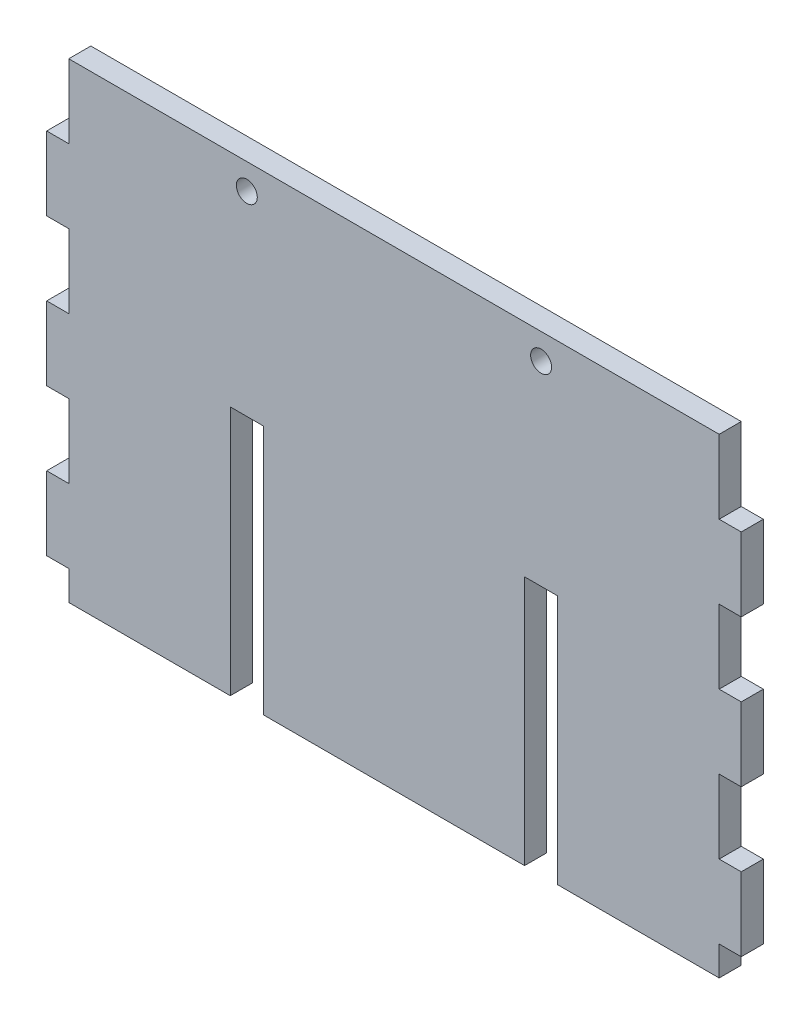
ISO-10303-21;
HEADER;
FILE_DESCRIPTION(('STEP AP214'),'2;1');
FILE_NAME('part.step','',(''),(''),'','','');
FILE_SCHEMA(('AUTOMOTIVE_DESIGN { 1 0 10303 214 1 1 1 1 }'));
ENDSEC;
DATA;
#1=APPLICATION_CONTEXT('core data for automotive mechanical design processes');
#2=APPLICATION_PROTOCOL_DEFINITION('international standard','automotive_design',2000,#1);
#3=PRODUCT_CONTEXT('',#1,'mechanical');
#4=PRODUCT('Part','Part','',(#3));
#5=PRODUCT_RELATED_PRODUCT_CATEGORY('part','',(#4));
#6=PRODUCT_DEFINITION_FORMATION('','',#4);
#7=PRODUCT_DEFINITION_CONTEXT('part definition',#1,'design');
#8=PRODUCT_DEFINITION('design','',#6,#7);
#9=PRODUCT_DEFINITION_SHAPE('','',#8);
#10=(LENGTH_UNIT() NAMED_UNIT(*) SI_UNIT(.MILLI.,.METRE.));
#11=(NAMED_UNIT(*) PLANE_ANGLE_UNIT() SI_UNIT($,.RADIAN.));
#12=(NAMED_UNIT(*) SI_UNIT($,.STERADIAN.) SOLID_ANGLE_UNIT());
#13=UNCERTAINTY_MEASURE_WITH_UNIT(LENGTH_MEASURE(1.E-05),#10,'distance_accuracy_value','');
#14=(GEOMETRIC_REPRESENTATION_CONTEXT(3) GLOBAL_UNCERTAINTY_ASSIGNED_CONTEXT((#13)) GLOBAL_UNIT_ASSIGNED_CONTEXT((#10,
#11,#12)) REPRESENTATION_CONTEXT('',''));
#15=CARTESIAN_POINT('',(0.,0.,0.));
#16=DIRECTION('',(0.,0.,1.));
#17=DIRECTION('',(1.,0.,0.));
#18=AXIS2_PLACEMENT_3D('',#15,#16,#17);
#19=CARTESIAN_POINT('',(-47.2,-32.,3.));
#20=DIRECTION('',(0.,1.,0.));
#21=DIRECTION('',(0.,0.,1.));
#22=AXIS2_PLACEMENT_3D('',#19,#20,#21);
#23=PLANE('',#22);
#24=DIRECTION('',(1.,0.,0.));
#25=VECTOR('',#24,1.);
#26=CARTESIAN_POINT('',(-47.2,-32.,0.));
#27=LINE('',#26,#25);
#28=CARTESIAN_POINT('',(-17.75,-32.,0.));
#29=VERTEX_POINT('',#28);
#30=CARTESIAN_POINT('',(17.75,-32.,0.));
#31=VERTEX_POINT('',#30);
#32=EDGE_CURVE('E534',#29,#31,#27,.T.);
#33=ORIENTED_EDGE('',*,*,#32,.T.);
#34=DIRECTION('',(0.,0.,-1.));
#35=VECTOR('',#34,1.);
#36=CARTESIAN_POINT('',(17.75,-32.,10.));
#37=LINE('',#36,#35);
#38=CARTESIAN_POINT('',(17.75,-32.,3.));
#39=VERTEX_POINT('',#38);
#40=EDGE_CURVE('E295',#39,#31,#37,.T.);
#41=ORIENTED_EDGE('',*,*,#40,.F.);
#42=DIRECTION('',(1.,0.,0.));
#43=VECTOR('',#42,1.);
#44=CARTESIAN_POINT('',(-47.2,-32.,3.));
#45=LINE('',#44,#43);
#46=CARTESIAN_POINT('',(-17.75,-32.,3.));
#47=VERTEX_POINT('',#46);
#48=EDGE_CURVE('E520',#47,#39,#45,.T.);
#49=ORIENTED_EDGE('',*,*,#48,.F.);
#50=DIRECTION('',(0.,0.,-1.));
#51=VECTOR('',#50,1.);
#52=CARTESIAN_POINT('',(-17.75,-32.,10.));
#53=LINE('',#52,#51);
#54=EDGE_CURVE('E309',#47,#29,#53,.T.);
#55=ORIENTED_EDGE('',*,*,#54,.T.);
#56=EDGE_LOOP('',(#33,#41,#49,#55));
#57=FACE_BOUND('',#56,.T.);
#58=ADVANCED_FACE('F35',(#57),#23,.F.);
#59=CARTESIAN_POINT('',(-44.1999999999996,-32.,0.));
#60=VERTEX_POINT('',#59);
#61=CARTESIAN_POINT('',(-22.25,-32.,0.));
#62=VERTEX_POINT('',#61);
#63=EDGE_CURVE('E508',#60,#62,#27,.T.);
#64=ORIENTED_EDGE('',*,*,#63,.T.);
#65=DIRECTION('',(0.,0.,-1.));
#66=VECTOR('',#65,1.);
#67=CARTESIAN_POINT('',(-22.25,-32.,10.));
#68=LINE('',#67,#66);
#69=CARTESIAN_POINT('',(-22.25,-32.,3.));
#70=VERTEX_POINT('',#69);
#71=EDGE_CURVE('E307',#70,#62,#68,.T.);
#72=ORIENTED_EDGE('',*,*,#71,.F.);
#73=CARTESIAN_POINT('',(-44.1999999999996,-32.,3.));
#74=VERTEX_POINT('',#73);
#75=EDGE_CURVE('E43',#74,#70,#45,.T.);
#76=ORIENTED_EDGE('',*,*,#75,.F.);
#77=DIRECTION('',(0.,0.,-1.));
#78=VECTOR('',#77,1.);
#79=CARTESIAN_POINT('',(-44.1999999999996,-32.,3.));
#80=LINE('',#79,#78);
#81=EDGE_CURVE('E493',#74,#60,#80,.T.);
#82=ORIENTED_EDGE('',*,*,#81,.T.);
#83=EDGE_LOOP('',(#64,#72,#76,#82));
#84=FACE_BOUND('',#83,.T.);
#85=ADVANCED_FACE('F613',(#84),#23,.F.);
#86=CARTESIAN_POINT('',(-47.2,-32.,3.));
#87=DIRECTION('',(-1.,0.,0.));
#88=DIRECTION('',(0.,0.,1.));
#89=AXIS2_PLACEMENT_3D('',#86,#87,#88);
#90=PLANE('',#89);
#91=DIRECTION('',(0.,0.,-1.));
#92=VECTOR('',#91,1.);
#93=CARTESIAN_POINT('',(-47.1999999999994,-28.,3.));
#94=LINE('',#93,#92);
#95=CARTESIAN_POINT('',(-47.1999999999994,-28.,3.));
#96=VERTEX_POINT('',#95);
#97=CARTESIAN_POINT('',(-47.2,-28.,0.));
#98=VERTEX_POINT('',#97);
#99=EDGE_CURVE('E474',#96,#98,#94,.T.);
#100=ORIENTED_EDGE('',*,*,#99,.F.);
#101=DIRECTION('',(0.,1.,0.));
#102=VECTOR('',#101,1.);
#103=CARTESIAN_POINT('',(-47.2,-32.,3.));
#104=LINE('',#103,#102);
#105=CARTESIAN_POINT('',(-47.1999999999996,-18.,3.));
#106=VERTEX_POINT('',#105);
#107=EDGE_CURVE('E509',#96,#106,#104,.T.);
#108=ORIENTED_EDGE('',*,*,#107,.T.);
#109=DIRECTION('',(0.,0.,-1.));
#110=VECTOR('',#109,1.);
#111=CARTESIAN_POINT('',(-47.1999999999996,-18.,3.));
#112=LINE('',#111,#110);
#113=CARTESIAN_POINT('',(-47.1999999999996,-18.,0.));
#114=VERTEX_POINT('',#113);
#115=EDGE_CURVE('E349',#106,#114,#112,.T.);
#116=ORIENTED_EDGE('',*,*,#115,.T.);
#117=DIRECTION('',(0.,1.,0.));
#118=VECTOR('',#117,1.);
#119=CARTESIAN_POINT('',(-47.2,-32.,0.));
#120=LINE('',#119,#118);
#121=EDGE_CURVE('E525',#98,#114,#120,.T.);
#122=ORIENTED_EDGE('',*,*,#121,.F.);
#123=EDGE_LOOP('',(#100,#108,#116,#122));
#124=FACE_BOUND('',#123,.T.);
#125=ADVANCED_FACE('F619',(#124),#90,.T.);
#126=DIRECTION('',(0.,0.,-1.));
#127=VECTOR('',#126,1.);
#128=CARTESIAN_POINT('',(-47.1999999999996,-7.99999999999999,3.));
#129=LINE('',#128,#127);
#130=CARTESIAN_POINT('',(-47.1999999999996,-7.99999999999999,3.));
#131=VERTEX_POINT('',#130);
#132=CARTESIAN_POINT('',(-47.2,-7.99999999999999,0.));
#133=VERTEX_POINT('',#132);
#134=EDGE_CURVE('E340',#131,#133,#129,.T.);
#135=ORIENTED_EDGE('',*,*,#134,.F.);
#136=CARTESIAN_POINT('',(-47.1999999999998,2.00000000000001,3.));
#137=VERTEX_POINT('',#136);
#138=EDGE_CURVE('E507',#131,#137,#104,.T.);
#139=ORIENTED_EDGE('',*,*,#138,.T.);
#140=DIRECTION('',(0.,0.,-1.));
#141=VECTOR('',#140,1.);
#142=CARTESIAN_POINT('',(-47.1999999999998,2.00000000000001,3.));
#143=LINE('',#142,#141);
#144=CARTESIAN_POINT('',(-47.1999999999998,2.00000000000001,0.));
#145=VERTEX_POINT('',#144);
#146=EDGE_CURVE('E345',#137,#145,#143,.T.);
#147=ORIENTED_EDGE('',*,*,#146,.T.);
#148=EDGE_CURVE('E524',#133,#145,#120,.T.);
#149=ORIENTED_EDGE('',*,*,#148,.F.);
#150=EDGE_LOOP('',(#135,#139,#147,#149));
#151=FACE_BOUND('',#150,.T.);
#152=ADVANCED_FACE('F629',(#151),#90,.T.);
#153=CARTESIAN_POINT('',(47.2,-32.,3.));
#154=DIRECTION('',(-1.,0.,0.));
#155=DIRECTION('',(0.,0.,1.));
#156=AXIS2_PLACEMENT_3D('',#153,#154,#155);
#157=PLANE('',#156);
#158=DIRECTION('',(0.,1.,0.));
#159=VECTOR('',#158,1.);
#160=CARTESIAN_POINT('',(47.2,-32.,0.));
#161=LINE('',#160,#159);
#162=CARTESIAN_POINT('',(47.1999999999996,-7.99999999999999,0.));
#163=VERTEX_POINT('',#162);
#164=CARTESIAN_POINT('',(47.1999999999998,2.00000000000001,0.));
#165=VERTEX_POINT('',#164);
#166=EDGE_CURVE('E531',#163,#165,#161,.T.);
#167=ORIENTED_EDGE('',*,*,#166,.T.);
#168=DIRECTION('',(0.,0.,-1.));
#169=VECTOR('',#168,1.);
#170=CARTESIAN_POINT('',(47.1999999999998,2.00000000000001,3.));
#171=LINE('',#170,#169);
#172=CARTESIAN_POINT('',(47.1999999999998,2.00000000000001,3.));
#173=VERTEX_POINT('',#172);
#174=EDGE_CURVE('E421',#173,#165,#171,.T.);
#175=ORIENTED_EDGE('',*,*,#174,.F.);
#176=DIRECTION('',(0.,1.,0.));
#177=VECTOR('',#176,1.);
#178=CARTESIAN_POINT('',(47.2,-32.,3.));
#179=LINE('',#178,#177);
#180=CARTESIAN_POINT('',(47.1999999999996,-7.99999999999999,3.));
#181=VERTEX_POINT('',#180);
#182=EDGE_CURVE('E516',#181,#173,#179,.T.);
#183=ORIENTED_EDGE('',*,*,#182,.F.);
#184=DIRECTION('',(0.,0.,-1.));
#185=VECTOR('',#184,1.);
#186=CARTESIAN_POINT('',(47.1999999999996,-7.99999999999999,3.));
#187=LINE('',#186,#185);
#188=EDGE_CURVE('E449',#181,#163,#187,.T.);
#189=ORIENTED_EDGE('',*,*,#188,.T.);
#190=EDGE_LOOP('',(#167,#175,#183,#189));
#191=FACE_BOUND('',#190,.T.);
#192=ADVANCED_FACE('F549',(#191),#157,.F.);
#193=CARTESIAN_POINT('',(47.1999999999994,-28.,0.));
#194=VERTEX_POINT('',#193);
#195=CARTESIAN_POINT('',(47.1999999999996,-18.,0.));
#196=VERTEX_POINT('',#195);
#197=EDGE_CURVE('E532',#194,#196,#161,.T.);
#198=ORIENTED_EDGE('',*,*,#197,.T.);
#199=DIRECTION('',(0.,0.,-1.));
#200=VECTOR('',#199,1.);
#201=CARTESIAN_POINT('',(47.1999999999996,-18.,3.));
#202=LINE('',#201,#200);
#203=CARTESIAN_POINT('',(47.1999999999996,-18.,3.));
#204=VERTEX_POINT('',#203);
#205=EDGE_CURVE('E447',#204,#196,#202,.T.);
#206=ORIENTED_EDGE('',*,*,#205,.F.);
#207=CARTESIAN_POINT('',(47.1999999999994,-28.,3.));
#208=VERTEX_POINT('',#207);
#209=EDGE_CURVE('E517',#208,#204,#179,.T.);
#210=ORIENTED_EDGE('',*,*,#209,.F.);
#211=DIRECTION('',(0.,0.,-1.));
#212=VECTOR('',#211,1.);
#213=CARTESIAN_POINT('',(47.1999999999994,-28.,3.));
#214=LINE('',#213,#212);
#215=EDGE_CURVE('E442',#208,#194,#214,.T.);
#216=ORIENTED_EDGE('',*,*,#215,.T.);
#217=EDGE_LOOP('',(#198,#206,#210,#216));
#218=FACE_BOUND('',#217,.T.);
#219=ADVANCED_FACE('F627',(#218),#157,.F.);
#220=DIRECTION('',(0.,0.,-1.));
#221=VECTOR('',#220,1.);
#222=CARTESIAN_POINT('',(-47.1999999999998,12.,3.));
#223=LINE('',#222,#221);
#224=CARTESIAN_POINT('',(-47.1999999999998,12.,3.));
#225=VERTEX_POINT('',#224);
#226=CARTESIAN_POINT('',(-47.2,12.,0.));
#227=VERTEX_POINT('',#226);
#228=EDGE_CURVE('E368',#225,#227,#223,.T.);
#229=ORIENTED_EDGE('',*,*,#228,.F.);
#230=CARTESIAN_POINT('',(-47.2,22.,3.));
#231=VERTEX_POINT('',#230);
#232=EDGE_CURVE('E504',#225,#231,#104,.T.);
#233=ORIENTED_EDGE('',*,*,#232,.T.);
#234=DIRECTION('',(0.,0.,-1.));
#235=VECTOR('',#234,1.);
#236=CARTESIAN_POINT('',(-47.2,22.,3.));
#237=LINE('',#236,#235);
#238=CARTESIAN_POINT('',(-47.2,22.,0.));
#239=VERTEX_POINT('',#238);
#240=EDGE_CURVE('E373',#231,#239,#237,.T.);
#241=ORIENTED_EDGE('',*,*,#240,.T.);
#242=EDGE_CURVE('E503',#227,#239,#120,.T.);
#243=ORIENTED_EDGE('',*,*,#242,.F.);
#244=EDGE_LOOP('',(#229,#233,#241,#243));
#245=FACE_BOUND('',#244,.T.);
#246=ADVANCED_FACE('F37',(#245),#90,.T.);
#247=CARTESIAN_POINT('',(22.25,-32.,3.));
#248=VERTEX_POINT('',#247);
#249=CARTESIAN_POINT('',(44.1999999999996,-32.,3.));
#250=VERTEX_POINT('',#249);
#251=EDGE_CURVE('E521',#248,#250,#45,.T.);
#252=ORIENTED_EDGE('',*,*,#251,.F.);
#253=DIRECTION('',(0.,0.,-1.));
#254=VECTOR('',#253,1.);
#255=CARTESIAN_POINT('',(22.25,-32.,10.));
#256=LINE('',#255,#254);
#257=CARTESIAN_POINT('',(22.25,-32.,0.));
#258=VERTEX_POINT('',#257);
#259=EDGE_CURVE('E279',#248,#258,#256,.T.);
#260=ORIENTED_EDGE('',*,*,#259,.T.);
#261=CARTESIAN_POINT('',(44.1999999999996,-32.,0.));
#262=VERTEX_POINT('',#261);
#263=EDGE_CURVE('E290',#258,#262,#27,.T.);
#264=ORIENTED_EDGE('',*,*,#263,.T.);
#265=DIRECTION('',(0.,0.,1.));
#266=VECTOR('',#265,1.);
#267=CARTESIAN_POINT('',(44.1999999999996,-32.,3.));
#268=LINE('',#267,#266);
#269=EDGE_CURVE('E500',#262,#250,#268,.T.);
#270=ORIENTED_EDGE('',*,*,#269,.T.);
#271=EDGE_LOOP('',(#252,#260,#264,#270));
#272=FACE_BOUND('',#271,.T.);
#273=ADVANCED_FACE('F615',(#272),#23,.F.);
#274=CARTESIAN_POINT('',(47.1999999999998,12.,3.));
#275=VERTEX_POINT('',#274);
#276=CARTESIAN_POINT('',(47.2,22.,3.));
#277=VERTEX_POINT('',#276);
#278=EDGE_CURVE('E513',#275,#277,#179,.T.);
#279=ORIENTED_EDGE('',*,*,#278,.F.);
#280=DIRECTION('',(0.,0.,-1.));
#281=VECTOR('',#280,1.);
#282=CARTESIAN_POINT('',(47.1999999999998,12.,3.));
#283=LINE('',#282,#281);
#284=CARTESIAN_POINT('',(47.1999999999998,12.,0.));
#285=VERTEX_POINT('',#284);
#286=EDGE_CURVE('E423',#275,#285,#283,.T.);
#287=ORIENTED_EDGE('',*,*,#286,.T.);
#288=CARTESIAN_POINT('',(47.2,22.,0.));
#289=VERTEX_POINT('',#288);
#290=EDGE_CURVE('E529',#285,#289,#161,.T.);
#291=ORIENTED_EDGE('',*,*,#290,.T.);
#292=DIRECTION('',(0.,0.,-1.));
#293=VECTOR('',#292,1.);
#294=CARTESIAN_POINT('',(47.2,22.,3.));
#295=LINE('',#294,#293);
#296=EDGE_CURVE('E494',#277,#289,#295,.T.);
#297=ORIENTED_EDGE('',*,*,#296,.F.);
#298=EDGE_LOOP('',(#279,#287,#291,#297));
#299=FACE_BOUND('',#298,.T.);
#300=ADVANCED_FACE('F609',(#299),#157,.F.);
#301=CARTESIAN_POINT('',(-47.2,32.,3.));
#302=DIRECTION('',(0.,1.,0.));
#303=DIRECTION('',(0.,0.,1.));
#304=AXIS2_PLACEMENT_3D('',#301,#302,#303);
#305=PLANE('',#304);
#306=DIRECTION('',(0.,0.,-1.));
#307=VECTOR('',#306,1.);
#308=CARTESIAN_POINT('',(-44.2000000000002,32.,3.));
#309=LINE('',#308,#307);
#310=CARTESIAN_POINT('',(-44.2000000000002,32.,3.));
#311=VERTEX_POINT('',#310);
#312=CARTESIAN_POINT('',(-44.2000000000002,32.,0.));
#313=VERTEX_POINT('',#312);
#314=EDGE_CURVE('E391',#311,#313,#309,.T.);
#315=ORIENTED_EDGE('',*,*,#314,.F.);
#316=DIRECTION('',(1.,0.,0.));
#317=VECTOR('',#316,1.);
#318=CARTESIAN_POINT('',(-47.2,32.,3.));
#319=LINE('',#318,#317);
#320=CARTESIAN_POINT('',(44.2000000000002,32.,3.));
#321=VERTEX_POINT('',#320);
#322=EDGE_CURVE('E510',#311,#321,#319,.T.);
#323=ORIENTED_EDGE('',*,*,#322,.T.);
#324=DIRECTION('',(0.,0.,-1.));
#325=VECTOR('',#324,1.);
#326=CARTESIAN_POINT('',(44.2000000000002,32.,3.));
#327=LINE('',#326,#325);
#328=CARTESIAN_POINT('',(44.2000000000002,32.,0.));
#329=VERTEX_POINT('',#328);
#330=EDGE_CURVE('E487',#321,#329,#327,.T.);
#331=ORIENTED_EDGE('',*,*,#330,.T.);
#332=DIRECTION('',(1.,0.,0.));
#333=VECTOR('',#332,1.);
#334=CARTESIAN_POINT('',(-47.2,32.,0.));
#335=LINE('',#334,#333);
#336=EDGE_CURVE('E526',#313,#329,#335,.T.);
#337=ORIENTED_EDGE('',*,*,#336,.F.);
#338=EDGE_LOOP('',(#315,#323,#331,#337));
#339=FACE_BOUND('',#338,.T.);
#340=ADVANCED_FACE('F603',(#339),#305,.T.);
#341=CARTESIAN_POINT('',(0.,0.,3.));
#342=DIRECTION('',(0.,0.,-1.));
#343=DIRECTION('',(-1.,0.,0.));
#344=AXIS2_PLACEMENT_3D('',#341,#342,#343);
#345=PLANE('',#344);
#346=CARTESIAN_POINT('',(20.,28.5,3.));
#347=DIRECTION('',(0.,0.,-1.));
#348=DIRECTION('',(-1.,0.,0.));
#349=AXIS2_PLACEMENT_3D('',#346,#347,#348);
#350=CIRCLE('',#349,1.4224);
#351=CARTESIAN_POINT('',(18.5776,28.5,3.));
#352=VERTEX_POINT('',#351);
#353=EDGE_CURVE('E301',#352,#352,#350,.T.);
#354=ORIENTED_EDGE('',*,*,#353,.T.);
#355=EDGE_LOOP('',(#354));
#356=FACE_BOUND('',#355,.T.);
#357=CARTESIAN_POINT('',(-20.,28.5,3.));
#358=DIRECTION('',(0.,0.,-1.));
#359=DIRECTION('',(-1.,0.,0.));
#360=AXIS2_PLACEMENT_3D('',#357,#358,#359);
#361=CIRCLE('',#360,1.4224);
#362=CARTESIAN_POINT('',(-21.4224,28.5,3.));
#363=VERTEX_POINT('',#362);
#364=EDGE_CURVE('E577',#363,#363,#361,.T.);
#365=ORIENTED_EDGE('',*,*,#364,.T.);
#366=EDGE_LOOP('',(#365));
#367=FACE_BOUND('',#366,.T.);
#368=ORIENTED_EDGE('',*,*,#48,.T.);
#369=DIRECTION('',(0.,1.,0.));
#370=VECTOR('',#369,1.);
#371=CARTESIAN_POINT('',(17.75,0.,3.));
#372=LINE('',#371,#370);
#373=CARTESIAN_POINT('',(17.75,2.,3.));
#374=VERTEX_POINT('',#373);
#375=EDGE_CURVE('E326',#39,#374,#372,.T.);
#376=ORIENTED_EDGE('',*,*,#375,.T.);
#377=DIRECTION('',(1.,0.,0.));
#378=VECTOR('',#377,1.);
#379=CARTESIAN_POINT('',(0.,2.,3.));
#380=LINE('',#379,#378);
#381=CARTESIAN_POINT('',(22.25,2.,3.));
#382=VERTEX_POINT('',#381);
#383=EDGE_CURVE('E323',#374,#382,#380,.T.);
#384=ORIENTED_EDGE('',*,*,#383,.T.);
#385=DIRECTION('',(0.,-1.,0.));
#386=VECTOR('',#385,1.);
#387=CARTESIAN_POINT('',(22.25,0.,3.));
#388=LINE('',#387,#386);
#389=EDGE_CURVE('E276',#382,#248,#388,.T.);
#390=ORIENTED_EDGE('',*,*,#389,.T.);
#391=ORIENTED_EDGE('',*,*,#251,.T.);
#392=DIRECTION('',(0.,1.,0.));
#393=VECTOR('',#392,1.);
#394=CARTESIAN_POINT('',(44.1999999999996,-28.,3.));
#395=LINE('',#394,#393);
#396=CARTESIAN_POINT('',(44.1999999999996,-28.,3.));
#397=VERTEX_POINT('',#396);
#398=EDGE_CURVE('E454',#250,#397,#395,.T.);
#399=ORIENTED_EDGE('',*,*,#398,.T.);
#400=DIRECTION('',(1.,0.,0.));
#401=VECTOR('',#400,1.);
#402=CARTESIAN_POINT('',(47.1999999999994,-28.,3.));
#403=LINE('',#402,#401);
#404=EDGE_CURVE('E457',#397,#208,#403,.T.);
#405=ORIENTED_EDGE('',*,*,#404,.T.);
#406=ORIENTED_EDGE('',*,*,#209,.T.);
#407=DIRECTION('',(-1.,0.,0.));
#408=VECTOR('',#407,1.);
#409=CARTESIAN_POINT('',(47.1999999999996,-18.,3.));
#410=LINE('',#409,#408);
#411=CARTESIAN_POINT('',(44.1999999999998,-18.,3.));
#412=VERTEX_POINT('',#411);
#413=EDGE_CURVE('E435',#204,#412,#410,.T.);
#414=ORIENTED_EDGE('',*,*,#413,.T.);
#415=DIRECTION('',(0.,1.,0.));
#416=VECTOR('',#415,1.);
#417=CARTESIAN_POINT('',(44.1999999999998,-7.99999999999999,3.));
#418=LINE('',#417,#416);
#419=CARTESIAN_POINT('',(44.1999999999998,-7.99999999999999,3.));
#420=VERTEX_POINT('',#419);
#421=EDGE_CURVE('E428',#412,#420,#418,.T.);
#422=ORIENTED_EDGE('',*,*,#421,.T.);
#423=DIRECTION('',(1.,0.,0.));
#424=VECTOR('',#423,1.);
#425=CARTESIAN_POINT('',(47.1999999999996,-7.99999999999999,3.));
#426=LINE('',#425,#424);
#427=EDGE_CURVE('E431',#420,#181,#426,.T.);
#428=ORIENTED_EDGE('',*,*,#427,.T.);
#429=ORIENTED_EDGE('',*,*,#182,.T.);
#430=DIRECTION('',(-1.,0.,0.));
#431=VECTOR('',#430,1.);
#432=CARTESIAN_POINT('',(47.1999999999998,2.00000000000001,3.));
#433=LINE('',#432,#431);
#434=CARTESIAN_POINT('',(44.2,2.00000000000001,3.));
#435=VERTEX_POINT('',#434);
#436=EDGE_CURVE('E407',#173,#435,#433,.T.);
#437=ORIENTED_EDGE('',*,*,#436,.T.);
#438=DIRECTION('',(0.,1.,0.));
#439=VECTOR('',#438,1.);
#440=CARTESIAN_POINT('',(44.2,12.,3.));
#441=LINE('',#440,#439);
#442=CARTESIAN_POINT('',(44.2,12.,3.));
#443=VERTEX_POINT('',#442);
#444=EDGE_CURVE('E400',#435,#443,#441,.T.);
#445=ORIENTED_EDGE('',*,*,#444,.T.);
#446=DIRECTION('',(1.,0.,0.));
#447=VECTOR('',#446,1.);
#448=CARTESIAN_POINT('',(47.1999999999998,12.,3.));
#449=LINE('',#448,#447);
#450=EDGE_CURVE('E403',#443,#275,#449,.T.);
#451=ORIENTED_EDGE('',*,*,#450,.T.);
#452=ORIENTED_EDGE('',*,*,#278,.T.);
#453=DIRECTION('',(-1.,0.,0.));
#454=VECTOR('',#453,1.);
#455=CARTESIAN_POINT('',(47.2,22.,3.));
#456=LINE('',#455,#454);
#457=CARTESIAN_POINT('',(44.2000000000002,22.,3.));
#458=VERTEX_POINT('',#457);
#459=EDGE_CURVE('E483',#277,#458,#456,.T.);
#460=ORIENTED_EDGE('',*,*,#459,.T.);
#461=DIRECTION('',(0.,1.,0.));
#462=VECTOR('',#461,1.);
#463=CARTESIAN_POINT('',(44.2000000000002,32.,3.));
#464=LINE('',#463,#462);
#465=EDGE_CURVE('E480',#458,#321,#464,.T.);
#466=ORIENTED_EDGE('',*,*,#465,.T.);
#467=ORIENTED_EDGE('',*,*,#322,.F.);
#468=DIRECTION('',(0.,-1.,0.));
#469=VECTOR('',#468,1.);
#470=CARTESIAN_POINT('',(-44.2000000000002,32.,3.));
#471=LINE('',#470,#469);
#472=CARTESIAN_POINT('',(-44.2000000000002,22.,3.));
#473=VERTEX_POINT('',#472);
#474=EDGE_CURVE('E384',#311,#473,#471,.T.);
#475=ORIENTED_EDGE('',*,*,#474,.T.);
#476=DIRECTION('',(-1.,0.,0.));
#477=VECTOR('',#476,1.);
#478=CARTESIAN_POINT('',(-47.2,22.,3.));
#479=LINE('',#478,#477);
#480=EDGE_CURVE('E387',#473,#231,#479,.T.);
#481=ORIENTED_EDGE('',*,*,#480,.T.);
#482=ORIENTED_EDGE('',*,*,#232,.F.);
#483=DIRECTION('',(1.,0.,0.));
#484=VECTOR('',#483,1.);
#485=CARTESIAN_POINT('',(-47.1999999999998,12.,3.));
#486=LINE('',#485,#484);
#487=CARTESIAN_POINT('',(-44.2,12.,3.));
#488=VERTEX_POINT('',#487);
#489=EDGE_CURVE('E358',#225,#488,#486,.T.);
#490=ORIENTED_EDGE('',*,*,#489,.T.);
#491=DIRECTION('',(0.,-1.,0.));
#492=VECTOR('',#491,1.);
#493=CARTESIAN_POINT('',(-44.2,12.,3.));
#494=LINE('',#493,#492);
#495=CARTESIAN_POINT('',(-44.2,2.00000000000001,3.));
#496=VERTEX_POINT('',#495);
#497=EDGE_CURVE('E361',#488,#496,#494,.T.);
#498=ORIENTED_EDGE('',*,*,#497,.T.);
#499=DIRECTION('',(-1.,0.,0.));
#500=VECTOR('',#499,1.);
#501=CARTESIAN_POINT('',(-47.1999999999998,2.00000000000001,3.));
#502=LINE('',#501,#500);
#503=EDGE_CURVE('E365',#496,#137,#502,.T.);
#504=ORIENTED_EDGE('',*,*,#503,.T.);
#505=ORIENTED_EDGE('',*,*,#138,.F.);
#506=DIRECTION('',(1.,0.,0.));
#507=VECTOR('',#506,1.);
#508=CARTESIAN_POINT('',(-47.1999999999996,-7.99999999999999,3.));
#509=LINE('',#508,#507);
#510=CARTESIAN_POINT('',(-44.1999999999998,-7.99999999999999,3.));
#511=VERTEX_POINT('',#510);
#512=EDGE_CURVE('E330',#131,#511,#509,.T.);
#513=ORIENTED_EDGE('',*,*,#512,.T.);
#514=DIRECTION('',(0.,-1.,0.));
#515=VECTOR('',#514,1.);
#516=CARTESIAN_POINT('',(-44.1999999999998,-7.99999999999999,3.));
#517=LINE('',#516,#515);
#518=CARTESIAN_POINT('',(-44.1999999999998,-18.,3.));
#519=VERTEX_POINT('',#518);
#520=EDGE_CURVE('E333',#511,#519,#517,.T.);
#521=ORIENTED_EDGE('',*,*,#520,.T.);
#522=DIRECTION('',(-1.,0.,0.));
#523=VECTOR('',#522,1.);
#524=CARTESIAN_POINT('',(-47.1999999999996,-18.,3.));
#525=LINE('',#524,#523);
#526=EDGE_CURVE('E337',#519,#106,#525,.T.);
#527=ORIENTED_EDGE('',*,*,#526,.T.);
#528=ORIENTED_EDGE('',*,*,#107,.F.);
#529=DIRECTION('',(1.,0.,0.));
#530=VECTOR('',#529,1.);
#531=CARTESIAN_POINT('',(-47.1999999999994,-28.,3.));
#532=LINE('',#531,#530);
#533=CARTESIAN_POINT('',(-44.1999999999996,-28.,3.));
#534=VERTEX_POINT('',#533);
#535=EDGE_CURVE('E467',#96,#534,#532,.T.);
#536=ORIENTED_EDGE('',*,*,#535,.T.);
#537=DIRECTION('',(0.,-1.,0.));
#538=VECTOR('',#537,1.);
#539=CARTESIAN_POINT('',(-44.1999999999996,-28.,3.));
#540=LINE('',#539,#538);
#541=EDGE_CURVE('E470',#534,#74,#540,.T.);
#542=ORIENTED_EDGE('',*,*,#541,.T.);
#543=ORIENTED_EDGE('',*,*,#75,.T.);
#544=DIRECTION('',(0.,1.,0.));
#545=VECTOR('',#544,1.);
#546=CARTESIAN_POINT('',(-22.25,0.,3.));
#547=LINE('',#546,#545);
#548=CARTESIAN_POINT('',(-22.25,1.99999999999999,3.));
#549=VERTEX_POINT('',#548);
#550=EDGE_CURVE('E320',#70,#549,#547,.T.);
#551=ORIENTED_EDGE('',*,*,#550,.T.);
#552=DIRECTION('',(1.,0.,0.));
#553=VECTOR('',#552,1.);
#554=CARTESIAN_POINT('',(0.,1.99999999999999,3.));
#555=LINE('',#554,#553);
#556=CARTESIAN_POINT('',(-17.75,1.99999999999999,3.));
#557=VERTEX_POINT('',#556);
#558=EDGE_CURVE('E297',#549,#557,#555,.T.);
#559=ORIENTED_EDGE('',*,*,#558,.T.);
#560=DIRECTION('',(0.,-1.,0.));
#561=VECTOR('',#560,1.);
#562=CARTESIAN_POINT('',(-17.75,0.,3.));
#563=LINE('',#562,#561);
#564=EDGE_CURVE('E317',#557,#47,#563,.T.);
#565=ORIENTED_EDGE('',*,*,#564,.T.);
#566=EDGE_LOOP('',(#368,#376,#384,#390,#391,#399,#405,#406,#414,#422,#428,#429,#437,#445,#451,
#452,#460,#466,#467,#475,#481,#482,#490,#498,#504,#505,#513,#521,#527,#528,#536,#542,#543,#551,
#559,#565));
#567=FACE_BOUND('',#566,.T.);
#568=ADVANCED_FACE('F562',(#356,#367,#567),#345,.F.);
#569=CARTESIAN_POINT('',(0.,0.,0.));
#570=DIRECTION('',(0.,0.,-1.));
#571=DIRECTION('',(-1.,0.,0.));
#572=AXIS2_PLACEMENT_3D('',#569,#570,#571);
#573=PLANE('',#572);
#574=CARTESIAN_POINT('',(20.,28.5,0.));
#575=DIRECTION('',(0.,0.,-1.));
#576=DIRECTION('',(-1.,0.,0.));
#577=AXIS2_PLACEMENT_3D('',#574,#575,#576);
#578=CIRCLE('',#577,1.4224);
#579=CARTESIAN_POINT('',(18.5776,28.5,0.));
#580=VERTEX_POINT('',#579);
#581=EDGE_CURVE('E580',#580,#580,#578,.T.);
#582=ORIENTED_EDGE('',*,*,#581,.F.);
#583=EDGE_LOOP('',(#582));
#584=FACE_BOUND('',#583,.T.);
#585=CARTESIAN_POINT('',(-20.,28.5,0.));
#586=DIRECTION('',(0.,0.,-1.));
#587=DIRECTION('',(-1.,0.,0.));
#588=AXIS2_PLACEMENT_3D('',#585,#586,#587);
#589=CIRCLE('',#588,1.4224);
#590=CARTESIAN_POINT('',(-21.4224,28.5,0.));
#591=VERTEX_POINT('',#590);
#592=EDGE_CURVE('E581',#591,#591,#589,.T.);
#593=ORIENTED_EDGE('',*,*,#592,.F.);
#594=EDGE_LOOP('',(#593));
#595=FACE_BOUND('',#594,.T.);
#596=DIRECTION('',(0.,1.,0.));
#597=VECTOR('',#596,1.);
#598=CARTESIAN_POINT('',(17.75,2.,0.));
#599=LINE('',#598,#597);
#600=CARTESIAN_POINT('',(17.75,2.,0.));
#601=VERTEX_POINT('',#600);
#602=EDGE_CURVE('E50',#31,#601,#599,.T.);
#603=ORIENTED_EDGE('',*,*,#602,.F.);
#604=ORIENTED_EDGE('',*,*,#32,.F.);
#605=DIRECTION('',(0.,-1.,0.));
#606=VECTOR('',#605,1.);
#607=CARTESIAN_POINT('',(-17.75,1.99999999999999,0.));
#608=LINE('',#607,#606);
#609=CARTESIAN_POINT('',(-17.75,1.99999999999999,0.));
#610=VERTEX_POINT('',#609);
#611=EDGE_CURVE('E304',#610,#29,#608,.T.);
#612=ORIENTED_EDGE('',*,*,#611,.F.);
#613=DIRECTION('',(1.,0.,0.));
#614=VECTOR('',#613,1.);
#615=CARTESIAN_POINT('',(-22.25,1.99999999999999,0.));
#616=LINE('',#615,#614);
#617=CARTESIAN_POINT('',(-22.25,1.99999999999999,0.));
#618=VERTEX_POINT('',#617);
#619=EDGE_CURVE('E300',#618,#610,#616,.T.);
#620=ORIENTED_EDGE('',*,*,#619,.F.);
#621=DIRECTION('',(0.,1.,0.));
#622=VECTOR('',#621,1.);
#623=CARTESIAN_POINT('',(-22.25,1.99999999999999,0.));
#624=LINE('',#623,#622);
#625=EDGE_CURVE('E58',#62,#618,#624,.T.);
#626=ORIENTED_EDGE('',*,*,#625,.F.);
#627=ORIENTED_EDGE('',*,*,#63,.F.);
#628=DIRECTION('',(0.,-1.,0.));
#629=VECTOR('',#628,1.);
#630=CARTESIAN_POINT('',(-44.1999999999996,-28.,0.));
#631=LINE('',#630,#629);
#632=CARTESIAN_POINT('',(-44.1999999999996,-28.,0.));
#633=VERTEX_POINT('',#632);
#634=EDGE_CURVE('E471',#633,#60,#631,.T.);
#635=ORIENTED_EDGE('',*,*,#634,.F.);
#636=DIRECTION('',(1.,0.,0.));
#637=VECTOR('',#636,1.);
#638=CARTESIAN_POINT('',(-47.1999999999994,-28.,0.));
#639=LINE('',#638,#637);
#640=EDGE_CURVE('E352',#98,#633,#639,.T.);
#641=ORIENTED_EDGE('',*,*,#640,.F.);
#642=ORIENTED_EDGE('',*,*,#121,.T.);
#643=DIRECTION('',(-1.,0.,0.));
#644=VECTOR('',#643,1.);
#645=CARTESIAN_POINT('',(-47.1999999999996,-18.,0.));
#646=LINE('',#645,#644);
#647=CARTESIAN_POINT('',(-44.1999999999998,-18.,0.));
#648=VERTEX_POINT('',#647);
#649=EDGE_CURVE('E334',#648,#114,#646,.T.);
#650=ORIENTED_EDGE('',*,*,#649,.F.);
#651=DIRECTION('',(0.,-1.,0.));
#652=VECTOR('',#651,1.);
#653=CARTESIAN_POINT('',(-44.1999999999998,-7.99999999999999,0.));
#654=LINE('',#653,#652);
#655=CARTESIAN_POINT('',(-44.1999999999998,-7.99999999999999,0.));
#656=VERTEX_POINT('',#655);
#657=EDGE_CURVE('E344',#656,#648,#654,.T.);
#658=ORIENTED_EDGE('',*,*,#657,.F.);
#659=DIRECTION('',(1.,0.,0.));
#660=VECTOR('',#659,1.);
#661=CARTESIAN_POINT('',(-47.1999999999996,-7.99999999999999,0.));
#662=LINE('',#661,#660);
#663=EDGE_CURVE('E341',#133,#656,#662,.T.);
#664=ORIENTED_EDGE('',*,*,#663,.F.);
#665=ORIENTED_EDGE('',*,*,#148,.T.);
#666=DIRECTION('',(-1.,0.,0.));
#667=VECTOR('',#666,1.);
#668=CARTESIAN_POINT('',(-47.1999999999998,2.00000000000001,0.));
#669=LINE('',#668,#667);
#670=CARTESIAN_POINT('',(-44.2,2.00000000000001,0.));
#671=VERTEX_POINT('',#670);
#672=EDGE_CURVE('E362',#671,#145,#669,.T.);
#673=ORIENTED_EDGE('',*,*,#672,.F.);
#674=DIRECTION('',(0.,-1.,0.));
#675=VECTOR('',#674,1.);
#676=CARTESIAN_POINT('',(-44.2,12.,0.));
#677=LINE('',#676,#675);
#678=CARTESIAN_POINT('',(-44.2,12.,0.));
#679=VERTEX_POINT('',#678);
#680=EDGE_CURVE('E372',#679,#671,#677,.T.);
#681=ORIENTED_EDGE('',*,*,#680,.F.);
#682=DIRECTION('',(1.,0.,0.));
#683=VECTOR('',#682,1.);
#684=CARTESIAN_POINT('',(-47.1999999999998,12.,0.));
#685=LINE('',#684,#683);
#686=EDGE_CURVE('E369',#227,#679,#685,.T.);
#687=ORIENTED_EDGE('',*,*,#686,.F.);
#688=ORIENTED_EDGE('',*,*,#242,.T.);
#689=DIRECTION('',(-1.,0.,0.));
#690=VECTOR('',#689,1.);
#691=CARTESIAN_POINT('',(-47.2,22.,0.));
#692=LINE('',#691,#690);
#693=CARTESIAN_POINT('',(-44.2000000000002,22.,0.));
#694=VERTEX_POINT('',#693);
#695=EDGE_CURVE('E388',#694,#239,#692,.T.);
#696=ORIENTED_EDGE('',*,*,#695,.F.);
#697=DIRECTION('',(0.,-1.,0.));
#698=VECTOR('',#697,1.);
#699=CARTESIAN_POINT('',(-44.2000000000002,32.,0.));
#700=LINE('',#699,#698);
#701=EDGE_CURVE('E329',#313,#694,#700,.T.);
#702=ORIENTED_EDGE('',*,*,#701,.F.);
#703=ORIENTED_EDGE('',*,*,#336,.T.);
#704=DIRECTION('',(0.,1.,0.));
#705=VECTOR('',#704,1.);
#706=CARTESIAN_POINT('',(44.2000000000002,32.,0.));
#707=LINE('',#706,#705);
#708=CARTESIAN_POINT('',(44.2000000000002,22.,0.));
#709=VERTEX_POINT('',#708);
#710=EDGE_CURVE('E420',#709,#329,#707,.T.);
#711=ORIENTED_EDGE('',*,*,#710,.F.);
#712=DIRECTION('',(-1.,0.,0.));
#713=VECTOR('',#712,1.);
#714=CARTESIAN_POINT('',(47.2,22.,0.));
#715=LINE('',#714,#713);
#716=EDGE_CURVE('E484',#289,#709,#715,.T.);
#717=ORIENTED_EDGE('',*,*,#716,.F.);
#718=ORIENTED_EDGE('',*,*,#290,.F.);
#719=DIRECTION('',(1.,0.,0.));
#720=VECTOR('',#719,1.);
#721=CARTESIAN_POINT('',(47.1999999999998,12.,0.));
#722=LINE('',#721,#720);
#723=CARTESIAN_POINT('',(44.2,12.,0.));
#724=VERTEX_POINT('',#723);
#725=EDGE_CURVE('E413',#724,#285,#722,.T.);
#726=ORIENTED_EDGE('',*,*,#725,.F.);
#727=DIRECTION('',(0.,1.,0.));
#728=VECTOR('',#727,1.);
#729=CARTESIAN_POINT('',(44.2,12.,0.));
#730=LINE('',#729,#728);
#731=CARTESIAN_POINT('',(44.2,2.00000000000001,0.));
#732=VERTEX_POINT('',#731);
#733=EDGE_CURVE('E411',#732,#724,#730,.T.);
#734=ORIENTED_EDGE('',*,*,#733,.F.);
#735=DIRECTION('',(-1.,0.,0.));
#736=VECTOR('',#735,1.);
#737=CARTESIAN_POINT('',(47.1999999999998,2.00000000000001,0.));
#738=LINE('',#737,#736);
#739=EDGE_CURVE('E404',#165,#732,#738,.T.);
#740=ORIENTED_EDGE('',*,*,#739,.F.);
#741=ORIENTED_EDGE('',*,*,#166,.F.);
#742=DIRECTION('',(1.,0.,0.));
#743=VECTOR('',#742,1.);
#744=CARTESIAN_POINT('',(47.1999999999996,-7.99999999999999,0.));
#745=LINE('',#744,#743);
#746=CARTESIAN_POINT('',(44.1999999999998,-7.99999999999999,0.));
#747=VERTEX_POINT('',#746);
#748=EDGE_CURVE('E441',#747,#163,#745,.T.);
#749=ORIENTED_EDGE('',*,*,#748,.F.);
#750=DIRECTION('',(0.,1.,0.));
#751=VECTOR('',#750,1.);
#752=CARTESIAN_POINT('',(44.1999999999998,-7.99999999999999,0.));
#753=LINE('',#752,#751);
#754=CARTESIAN_POINT('',(44.1999999999998,-18.,0.));
#755=VERTEX_POINT('',#754);
#756=EDGE_CURVE('E439',#755,#747,#753,.T.);
#757=ORIENTED_EDGE('',*,*,#756,.F.);
#758=DIRECTION('',(-1.,0.,0.));
#759=VECTOR('',#758,1.);
#760=CARTESIAN_POINT('',(47.1999999999996,-18.,0.));
#761=LINE('',#760,#759);
#762=EDGE_CURVE('E432',#196,#755,#761,.T.);
#763=ORIENTED_EDGE('',*,*,#762,.F.);
#764=ORIENTED_EDGE('',*,*,#197,.F.);
#765=DIRECTION('',(1.,0.,0.));
#766=VECTOR('',#765,1.);
#767=CARTESIAN_POINT('',(47.1999999999994,-28.,0.));
#768=LINE('',#767,#766);
#769=CARTESIAN_POINT('',(44.1999999999996,-28.,0.));
#770=VERTEX_POINT('',#769);
#771=EDGE_CURVE('E458',#770,#194,#768,.T.);
#772=ORIENTED_EDGE('',*,*,#771,.F.);
#773=DIRECTION('',(0.,1.,0.));
#774=VECTOR('',#773,1.);
#775=CARTESIAN_POINT('',(44.1999999999995,0.,0.));
#776=LINE('',#775,#774);
#777=EDGE_CURVE('E11',#262,#770,#776,.T.);
#778=ORIENTED_EDGE('',*,*,#777,.F.);
#779=ORIENTED_EDGE('',*,*,#263,.F.);
#780=DIRECTION('',(0.,-1.,0.));
#781=VECTOR('',#780,1.);
#782=CARTESIAN_POINT('',(22.25,2.,0.));
#783=LINE('',#782,#781);
#784=CARTESIAN_POINT('',(22.25,2.,0.));
#785=VERTEX_POINT('',#784);
#786=EDGE_CURVE('E273',#785,#258,#783,.T.);
#787=ORIENTED_EDGE('',*,*,#786,.F.);
#788=DIRECTION('',(1.,0.,0.));
#789=VECTOR('',#788,1.);
#790=CARTESIAN_POINT('',(22.25,2.,0.));
#791=LINE('',#790,#789);
#792=EDGE_CURVE('E283',#601,#785,#791,.T.);
#793=ORIENTED_EDGE('',*,*,#792,.F.);
#794=EDGE_LOOP('',(#603,#604,#612,#620,#626,#627,#635,#641,#642,#650,#658,#664,#665,#673,#681,
#687,#688,#696,#702,#703,#711,#717,#718,#726,#734,#740,#741,#749,#757,#763,#764,#772,#778,#779,
#787,#793));
#795=FACE_BOUND('',#794,.T.);
#796=ADVANCED_FACE('F288',(#584,#595,#795),#573,.T.);
#797=CARTESIAN_POINT('',(44.2000000000002,32.,3.));
#798=DIRECTION('',(-1.,0.,0.));
#799=DIRECTION('',(0.,-1.,0.));
#800=AXIS2_PLACEMENT_3D('',#797,#798,#799);
#801=PLANE('',#800);
#802=ORIENTED_EDGE('',*,*,#710,.T.);
#803=ORIENTED_EDGE('',*,*,#330,.F.);
#804=ORIENTED_EDGE('',*,*,#465,.F.);
#805=DIRECTION('',(0.,0.,-1.));
#806=VECTOR('',#805,1.);
#807=CARTESIAN_POINT('',(44.2000000000002,22.,3.));
#808=LINE('',#807,#806);
#809=EDGE_CURVE('E491',#458,#709,#808,.T.);
#810=ORIENTED_EDGE('',*,*,#809,.T.);
#811=EDGE_LOOP('',(#802,#803,#804,#810));
#812=FACE_BOUND('',#811,.T.);
#813=ADVANCED_FACE('F592',(#812),#801,.F.);
#814=CARTESIAN_POINT('',(47.2,22.,3.));
#815=DIRECTION('',(0.,-1.,0.));
#816=DIRECTION('',(0.,0.,-1.));
#817=AXIS2_PLACEMENT_3D('',#814,#815,#816);
#818=PLANE('',#817);
#819=ORIENTED_EDGE('',*,*,#716,.T.);
#820=ORIENTED_EDGE('',*,*,#809,.F.);
#821=ORIENTED_EDGE('',*,*,#459,.F.);
#822=ORIENTED_EDGE('',*,*,#296,.T.);
#823=EDGE_LOOP('',(#819,#820,#821,#822));
#824=FACE_BOUND('',#823,.T.);
#825=ADVANCED_FACE('F670',(#824),#818,.F.);
#826=CARTESIAN_POINT('',(-47.2,22.,3.));
#827=DIRECTION('',(0.,-1.,0.));
#828=DIRECTION('',(0.,0.,-1.));
#829=AXIS2_PLACEMENT_3D('',#826,#827,#828);
#830=PLANE('',#829);
#831=ORIENTED_EDGE('',*,*,#695,.T.);
#832=ORIENTED_EDGE('',*,*,#240,.F.);
#833=ORIENTED_EDGE('',*,*,#480,.F.);
#834=DIRECTION('',(0.,0.,-1.));
#835=VECTOR('',#834,1.);
#836=CARTESIAN_POINT('',(-44.2000000000002,22.,3.));
#837=LINE('',#836,#835);
#838=EDGE_CURVE('E397',#473,#694,#837,.T.);
#839=ORIENTED_EDGE('',*,*,#838,.T.);
#840=EDGE_LOOP('',(#831,#832,#833,#839));
#841=FACE_BOUND('',#840,.T.);
#842=ADVANCED_FACE('F672',(#841),#830,.F.);
#843=CARTESIAN_POINT('',(-44.2000000000002,32.,3.));
#844=DIRECTION('',(1.,0.,0.));
#845=DIRECTION('',(0.,1.,0.));
#846=AXIS2_PLACEMENT_3D('',#843,#844,#845);
#847=PLANE('',#846);
#848=ORIENTED_EDGE('',*,*,#701,.T.);
#849=ORIENTED_EDGE('',*,*,#838,.F.);
#850=ORIENTED_EDGE('',*,*,#474,.F.);
#851=ORIENTED_EDGE('',*,*,#314,.T.);
#852=EDGE_LOOP('',(#848,#849,#850,#851));
#853=FACE_BOUND('',#852,.T.);
#854=ADVANCED_FACE('F687',(#853),#847,.F.);
#855=CARTESIAN_POINT('',(-47.1999999999998,2.00000000000001,3.));
#856=DIRECTION('',(0.,-1.,0.));
#857=DIRECTION('',(0.,0.,-1.));
#858=AXIS2_PLACEMENT_3D('',#855,#856,#857);
#859=PLANE('',#858);
#860=ORIENTED_EDGE('',*,*,#672,.T.);
#861=ORIENTED_EDGE('',*,*,#146,.F.);
#862=ORIENTED_EDGE('',*,*,#503,.F.);
#863=DIRECTION('',(0.,0.,-1.));
#864=VECTOR('',#863,1.);
#865=CARTESIAN_POINT('',(-44.2,2.00000000000001,3.));
#866=LINE('',#865,#864);
#867=EDGE_CURVE('E379',#496,#671,#866,.T.);
#868=ORIENTED_EDGE('',*,*,#867,.T.);
#869=EDGE_LOOP('',(#860,#861,#862,#868));
#870=FACE_BOUND('',#869,.T.);
#871=ADVANCED_FACE('F708',(#870),#859,.F.);
#872=CARTESIAN_POINT('',(-44.2,12.,3.));
#873=DIRECTION('',(1.,0.,0.));
#874=DIRECTION('',(0.,1.,0.));
#875=AXIS2_PLACEMENT_3D('',#872,#873,#874);
#876=PLANE('',#875);
#877=ORIENTED_EDGE('',*,*,#680,.T.);
#878=ORIENTED_EDGE('',*,*,#867,.F.);
#879=ORIENTED_EDGE('',*,*,#497,.F.);
#880=DIRECTION('',(0.,0.,-1.));
#881=VECTOR('',#880,1.);
#882=CARTESIAN_POINT('',(-44.2,12.,3.));
#883=LINE('',#882,#881);
#884=EDGE_CURVE('E381',#488,#679,#883,.T.);
#885=ORIENTED_EDGE('',*,*,#884,.T.);
#886=EDGE_LOOP('',(#877,#878,#879,#885));
#887=FACE_BOUND('',#886,.T.);
#888=ADVANCED_FACE('F716',(#887),#876,.F.);
#889=CARTESIAN_POINT('',(-47.1999999999998,12.,3.));
#890=DIRECTION('',(0.,1.,0.));
#891=DIRECTION('',(-1.,0.,0.));
#892=AXIS2_PLACEMENT_3D('',#889,#890,#891);
#893=PLANE('',#892);
#894=ORIENTED_EDGE('',*,*,#686,.T.);
#895=ORIENTED_EDGE('',*,*,#884,.F.);
#896=ORIENTED_EDGE('',*,*,#489,.F.);
#897=ORIENTED_EDGE('',*,*,#228,.T.);
#898=EDGE_LOOP('',(#894,#895,#896,#897));
#899=FACE_BOUND('',#898,.T.);
#900=ADVANCED_FACE('F712',(#899),#893,.F.);
#901=CARTESIAN_POINT('',(-47.1999999999996,-18.,3.));
#902=DIRECTION('',(0.,-1.,0.));
#903=DIRECTION('',(0.,0.,-1.));
#904=AXIS2_PLACEMENT_3D('',#901,#902,#903);
#905=PLANE('',#904);
#906=ORIENTED_EDGE('',*,*,#649,.T.);
#907=ORIENTED_EDGE('',*,*,#115,.F.);
#908=ORIENTED_EDGE('',*,*,#526,.F.);
#909=DIRECTION('',(0.,0.,-1.));
#910=VECTOR('',#909,1.);
#911=CARTESIAN_POINT('',(-44.1999999999998,-18.,3.));
#912=LINE('',#911,#910);
#913=EDGE_CURVE('E353',#519,#648,#912,.T.);
#914=ORIENTED_EDGE('',*,*,#913,.T.);
#915=EDGE_LOOP('',(#906,#907,#908,#914));
#916=FACE_BOUND('',#915,.T.);
#917=ADVANCED_FACE('F715',(#916),#905,.F.);
#918=CARTESIAN_POINT('',(-44.1999999999998,-7.99999999999999,3.));
#919=DIRECTION('',(1.,0.,0.));
#920=DIRECTION('',(0.,1.,0.));
#921=AXIS2_PLACEMENT_3D('',#918,#919,#920);
#922=PLANE('',#921);
#923=ORIENTED_EDGE('',*,*,#657,.T.);
#924=ORIENTED_EDGE('',*,*,#913,.F.);
#925=ORIENTED_EDGE('',*,*,#520,.F.);
#926=DIRECTION('',(0.,0.,-1.));
#927=VECTOR('',#926,1.);
#928=CARTESIAN_POINT('',(-44.1999999999998,-7.99999999999999,3.));
#929=LINE('',#928,#927);
#930=EDGE_CURVE('E355',#511,#656,#929,.T.);
#931=ORIENTED_EDGE('',*,*,#930,.T.);
#932=EDGE_LOOP('',(#923,#924,#925,#931));
#933=FACE_BOUND('',#932,.T.);
#934=ADVANCED_FACE('F726',(#933),#922,.F.);
#935=CARTESIAN_POINT('',(-47.1999999999996,-7.99999999999999,3.));
#936=DIRECTION('',(0.,1.,0.));
#937=DIRECTION('',(-1.,0.,0.));
#938=AXIS2_PLACEMENT_3D('',#935,#936,#937);
#939=PLANE('',#938);
#940=ORIENTED_EDGE('',*,*,#663,.T.);
#941=ORIENTED_EDGE('',*,*,#930,.F.);
#942=ORIENTED_EDGE('',*,*,#512,.F.);
#943=ORIENTED_EDGE('',*,*,#134,.T.);
#944=EDGE_LOOP('',(#940,#941,#942,#943));
#945=FACE_BOUND('',#944,.T.);
#946=ADVANCED_FACE('F665',(#945),#939,.F.);
#947=CARTESIAN_POINT('',(-44.1999999999996,-28.,3.));
#948=DIRECTION('',(1.,0.,0.));
#949=DIRECTION('',(0.,1.,0.));
#950=AXIS2_PLACEMENT_3D('',#947,#948,#949);
#951=PLANE('',#950);
#952=ORIENTED_EDGE('',*,*,#541,.F.);
#953=DIRECTION('',(0.,0.,-1.));
#954=VECTOR('',#953,1.);
#955=CARTESIAN_POINT('',(-44.1999999999996,-28.,3.));
#956=LINE('',#955,#954);
#957=EDGE_CURVE('E463',#534,#633,#956,.T.);
#958=ORIENTED_EDGE('',*,*,#957,.T.);
#959=ORIENTED_EDGE('',*,*,#634,.T.);
#960=ORIENTED_EDGE('',*,*,#81,.F.);
#961=EDGE_LOOP('',(#952,#958,#959,#960));
#962=FACE_BOUND('',#961,.T.);
#963=ADVANCED_FACE('F662',(#962),#951,.F.);
#964=CARTESIAN_POINT('',(-47.1999999999994,-28.,3.));
#965=DIRECTION('',(0.,1.,0.));
#966=DIRECTION('',(-1.,0.,0.));
#967=AXIS2_PLACEMENT_3D('',#964,#965,#966);
#968=PLANE('',#967);
#969=ORIENTED_EDGE('',*,*,#640,.T.);
#970=ORIENTED_EDGE('',*,*,#957,.F.);
#971=ORIENTED_EDGE('',*,*,#535,.F.);
#972=ORIENTED_EDGE('',*,*,#99,.T.);
#973=EDGE_LOOP('',(#969,#970,#971,#972));
#974=FACE_BOUND('',#973,.T.);
#975=ADVANCED_FACE('F661',(#974),#968,.F.);
#976=CARTESIAN_POINT('',(44.1999999999996,-28.,3.));
#977=DIRECTION('',(-1.,0.,0.));
#978=DIRECTION('',(0.,-1.,0.));
#979=AXIS2_PLACEMENT_3D('',#976,#977,#978);
#980=PLANE('',#979);
#981=ORIENTED_EDGE('',*,*,#777,.T.);
#982=DIRECTION('',(0.,0.,-1.));
#983=VECTOR('',#982,1.);
#984=CARTESIAN_POINT('',(44.1999999999996,-28.,3.));
#985=LINE('',#984,#983);
#986=EDGE_CURVE('E461',#397,#770,#985,.T.);
#987=ORIENTED_EDGE('',*,*,#986,.F.);
#988=ORIENTED_EDGE('',*,*,#398,.F.);
#989=ORIENTED_EDGE('',*,*,#269,.F.);
#990=EDGE_LOOP('',(#981,#987,#988,#989));
#991=FACE_BOUND('',#990,.T.);
#992=ADVANCED_FACE('F631',(#991),#980,.F.);
#993=CARTESIAN_POINT('',(47.1999999999994,-28.,3.));
#994=DIRECTION('',(0.,1.,0.));
#995=DIRECTION('',(-1.,0.,0.));
#996=AXIS2_PLACEMENT_3D('',#993,#994,#995);
#997=PLANE('',#996);
#998=ORIENTED_EDGE('',*,*,#771,.T.);
#999=ORIENTED_EDGE('',*,*,#215,.F.);
#1000=ORIENTED_EDGE('',*,*,#404,.F.);
#1001=ORIENTED_EDGE('',*,*,#986,.T.);
#1002=EDGE_LOOP('',(#998,#999,#1000,#1001));
#1003=FACE_BOUND('',#1002,.T.);
#1004=ADVANCED_FACE('F635',(#1003),#997,.F.);
#1005=CARTESIAN_POINT('',(44.1999999999998,-7.99999999999999,3.));
#1006=DIRECTION('',(-1.,0.,0.));
#1007=DIRECTION('',(0.,-1.,0.));
#1008=AXIS2_PLACEMENT_3D('',#1005,#1006,#1007);
#1009=PLANE('',#1008);
#1010=ORIENTED_EDGE('',*,*,#756,.T.);
#1011=DIRECTION('',(0.,0.,-1.));
#1012=VECTOR('',#1011,1.);
#1013=CARTESIAN_POINT('',(44.1999999999998,-7.99999999999999,3.));
#1014=LINE('',#1013,#1012);
#1015=EDGE_CURVE('E438',#420,#747,#1014,.T.);
#1016=ORIENTED_EDGE('',*,*,#1015,.F.);
#1017=ORIENTED_EDGE('',*,*,#421,.F.);
#1018=DIRECTION('',(0.,0.,-1.));
#1019=VECTOR('',#1018,1.);
#1020=CARTESIAN_POINT('',(44.1999999999998,-18.,3.));
#1021=LINE('',#1020,#1019);
#1022=EDGE_CURVE('E414',#412,#755,#1021,.T.);
#1023=ORIENTED_EDGE('',*,*,#1022,.T.);
#1024=EDGE_LOOP('',(#1010,#1016,#1017,#1023));
#1025=FACE_BOUND('',#1024,.T.);
#1026=ADVANCED_FACE('F640',(#1025),#1009,.F.);
#1027=CARTESIAN_POINT('',(47.1999999999996,-18.,3.));
#1028=DIRECTION('',(0.,-1.,0.));
#1029=DIRECTION('',(0.,0.,-1.));
#1030=AXIS2_PLACEMENT_3D('',#1027,#1028,#1029);
#1031=PLANE('',#1030);
#1032=ORIENTED_EDGE('',*,*,#762,.T.);
#1033=ORIENTED_EDGE('',*,*,#1022,.F.);
#1034=ORIENTED_EDGE('',*,*,#413,.F.);
#1035=ORIENTED_EDGE('',*,*,#205,.T.);
#1036=EDGE_LOOP('',(#1032,#1033,#1034,#1035));
#1037=FACE_BOUND('',#1036,.T.);
#1038=ADVANCED_FACE('F638',(#1037),#1031,.F.);
#1039=CARTESIAN_POINT('',(47.1999999999996,-7.99999999999999,3.));
#1040=DIRECTION('',(0.,1.,0.));
#1041=DIRECTION('',(-1.,0.,0.));
#1042=AXIS2_PLACEMENT_3D('',#1039,#1040,#1041);
#1043=PLANE('',#1042);
#1044=ORIENTED_EDGE('',*,*,#748,.T.);
#1045=ORIENTED_EDGE('',*,*,#188,.F.);
#1046=ORIENTED_EDGE('',*,*,#427,.F.);
#1047=ORIENTED_EDGE('',*,*,#1015,.T.);
#1048=EDGE_LOOP('',(#1044,#1045,#1046,#1047));
#1049=FACE_BOUND('',#1048,.T.);
#1050=ADVANCED_FACE('F643',(#1049),#1043,.F.);
#1051=CARTESIAN_POINT('',(44.2,12.,3.));
#1052=DIRECTION('',(-1.,0.,0.));
#1053=DIRECTION('',(0.,-1.,0.));
#1054=AXIS2_PLACEMENT_3D('',#1051,#1052,#1053);
#1055=PLANE('',#1054);
#1056=ORIENTED_EDGE('',*,*,#733,.T.);
#1057=DIRECTION('',(0.,0.,-1.));
#1058=VECTOR('',#1057,1.);
#1059=CARTESIAN_POINT('',(44.2,12.,3.));
#1060=LINE('',#1059,#1058);
#1061=EDGE_CURVE('E410',#443,#724,#1060,.T.);
#1062=ORIENTED_EDGE('',*,*,#1061,.F.);
#1063=ORIENTED_EDGE('',*,*,#444,.F.);
#1064=DIRECTION('',(0.,0.,-1.));
#1065=VECTOR('',#1064,1.);
#1066=CARTESIAN_POINT('',(44.2,2.00000000000001,3.));
#1067=LINE('',#1066,#1065);
#1068=EDGE_CURVE('E418',#435,#732,#1067,.T.);
#1069=ORIENTED_EDGE('',*,*,#1068,.T.);
#1070=EDGE_LOOP('',(#1056,#1062,#1063,#1069));
#1071=FACE_BOUND('',#1070,.T.);
#1072=ADVANCED_FACE('F645',(#1071),#1055,.F.);
#1073=CARTESIAN_POINT('',(47.1999999999998,2.00000000000001,3.));
#1074=DIRECTION('',(0.,-1.,0.));
#1075=DIRECTION('',(0.,0.,-1.));
#1076=AXIS2_PLACEMENT_3D('',#1073,#1074,#1075);
#1077=PLANE('',#1076);
#1078=ORIENTED_EDGE('',*,*,#739,.T.);
#1079=ORIENTED_EDGE('',*,*,#1068,.F.);
#1080=ORIENTED_EDGE('',*,*,#436,.F.);
#1081=ORIENTED_EDGE('',*,*,#174,.T.);
#1082=EDGE_LOOP('',(#1078,#1079,#1080,#1081));
#1083=FACE_BOUND('',#1082,.T.);
#1084=ADVANCED_FACE('F558',(#1083),#1077,.F.);
#1085=CARTESIAN_POINT('',(47.1999999999998,12.,3.));
#1086=DIRECTION('',(0.,1.,0.));
#1087=DIRECTION('',(-1.,0.,0.));
#1088=AXIS2_PLACEMENT_3D('',#1085,#1086,#1087);
#1089=PLANE('',#1088);
#1090=ORIENTED_EDGE('',*,*,#725,.T.);
#1091=ORIENTED_EDGE('',*,*,#286,.F.);
#1092=ORIENTED_EDGE('',*,*,#450,.F.);
#1093=ORIENTED_EDGE('',*,*,#1061,.T.);
#1094=EDGE_LOOP('',(#1090,#1091,#1092,#1093));
#1095=FACE_BOUND('',#1094,.T.);
#1096=ADVANCED_FACE('F693',(#1095),#1089,.F.);
#1097=CARTESIAN_POINT('',(-22.25,1.99999999999999,10.));
#1098=DIRECTION('',(-1.,0.,0.));
#1099=DIRECTION('',(0.,-1.,0.));
#1100=AXIS2_PLACEMENT_3D('',#1097,#1098,#1099);
#1101=PLANE('',#1100);
#1102=ORIENTED_EDGE('',*,*,#71,.T.);
#1103=ORIENTED_EDGE('',*,*,#625,.T.);
#1104=DIRECTION('',(0.,0.,-1.));
#1105=VECTOR('',#1104,1.);
#1106=CARTESIAN_POINT('',(-22.25,1.99999999999999,10.));
#1107=LINE('',#1106,#1105);
#1108=EDGE_CURVE('E306',#549,#618,#1107,.T.);
#1109=ORIENTED_EDGE('',*,*,#1108,.F.);
#1110=ORIENTED_EDGE('',*,*,#550,.F.);
#1111=EDGE_LOOP('',(#1102,#1103,#1109,#1110));
#1112=FACE_BOUND('',#1111,.T.);
#1113=ADVANCED_FACE('F696',(#1112),#1101,.F.);
#1114=CARTESIAN_POINT('',(-17.75,1.99999999999999,10.));
#1115=DIRECTION('',(1.,0.,0.));
#1116=DIRECTION('',(0.,1.,0.));
#1117=AXIS2_PLACEMENT_3D('',#1114,#1115,#1116);
#1118=PLANE('',#1117);
#1119=DIRECTION('',(0.,0.,-1.));
#1120=VECTOR('',#1119,1.);
#1121=CARTESIAN_POINT('',(-17.75,1.99999999999999,10.));
#1122=LINE('',#1121,#1120);
#1123=EDGE_CURVE('E312',#557,#610,#1122,.T.);
#1124=ORIENTED_EDGE('',*,*,#1123,.T.);
#1125=ORIENTED_EDGE('',*,*,#611,.T.);
#1126=ORIENTED_EDGE('',*,*,#54,.F.);
#1127=ORIENTED_EDGE('',*,*,#564,.F.);
#1128=EDGE_LOOP('',(#1124,#1125,#1126,#1127));
#1129=FACE_BOUND('',#1128,.T.);
#1130=ADVANCED_FACE('F702',(#1129),#1118,.F.);
#1131=CARTESIAN_POINT('',(-22.25,1.99999999999999,10.));
#1132=DIRECTION('',(0.,1.,0.));
#1133=DIRECTION('',(-1.,0.,0.));
#1134=AXIS2_PLACEMENT_3D('',#1131,#1132,#1133);
#1135=PLANE('',#1134);
#1136=ORIENTED_EDGE('',*,*,#1108,.T.);
#1137=ORIENTED_EDGE('',*,*,#619,.T.);
#1138=ORIENTED_EDGE('',*,*,#1123,.F.);
#1139=ORIENTED_EDGE('',*,*,#558,.F.);
#1140=EDGE_LOOP('',(#1136,#1137,#1138,#1139));
#1141=FACE_BOUND('',#1140,.T.);
#1142=ADVANCED_FACE('F734',(#1141),#1135,.F.);
#1143=CARTESIAN_POINT('',(17.75,2.,10.));
#1144=DIRECTION('',(-1.,0.,0.));
#1145=DIRECTION('',(0.,-1.,0.));
#1146=AXIS2_PLACEMENT_3D('',#1143,#1144,#1145);
#1147=PLANE('',#1146);
#1148=ORIENTED_EDGE('',*,*,#40,.T.);
#1149=ORIENTED_EDGE('',*,*,#602,.T.);
#1150=DIRECTION('',(0.,0.,-1.));
#1151=VECTOR('',#1150,1.);
#1152=CARTESIAN_POINT('',(17.75,2.,10.));
#1153=LINE('',#1152,#1151);
#1154=EDGE_CURVE('E280',#374,#601,#1153,.T.);
#1155=ORIENTED_EDGE('',*,*,#1154,.F.);
#1156=ORIENTED_EDGE('',*,*,#375,.F.);
#1157=EDGE_LOOP('',(#1148,#1149,#1155,#1156));
#1158=FACE_BOUND('',#1157,.T.);
#1159=ADVANCED_FACE('F572',(#1158),#1147,.F.);
#1160=CARTESIAN_POINT('',(22.25,2.,10.));
#1161=DIRECTION('',(1.,0.,0.));
#1162=DIRECTION('',(0.,1.,0.));
#1163=AXIS2_PLACEMENT_3D('',#1160,#1161,#1162);
#1164=PLANE('',#1163);
#1165=DIRECTION('',(0.,0.,-1.));
#1166=VECTOR('',#1165,1.);
#1167=CARTESIAN_POINT('',(22.25,2.,10.));
#1168=LINE('',#1167,#1166);
#1169=EDGE_CURVE('E269',#382,#785,#1168,.T.);
#1170=ORIENTED_EDGE('',*,*,#1169,.T.);
#1171=ORIENTED_EDGE('',*,*,#786,.T.);
#1172=ORIENTED_EDGE('',*,*,#259,.F.);
#1173=ORIENTED_EDGE('',*,*,#389,.F.);
#1174=EDGE_LOOP('',(#1170,#1171,#1172,#1173));
#1175=FACE_BOUND('',#1174,.T.);
#1176=ADVANCED_FACE('F271',(#1175),#1164,.F.);
#1177=CARTESIAN_POINT('',(22.25,2.,10.));
#1178=DIRECTION('',(0.,1.,0.));
#1179=DIRECTION('',(-1.,0.,0.));
#1180=AXIS2_PLACEMENT_3D('',#1177,#1178,#1179);
#1181=PLANE('',#1180);
#1182=ORIENTED_EDGE('',*,*,#1154,.T.);
#1183=ORIENTED_EDGE('',*,*,#792,.T.);
#1184=ORIENTED_EDGE('',*,*,#1169,.F.);
#1185=ORIENTED_EDGE('',*,*,#383,.F.);
#1186=EDGE_LOOP('',(#1182,#1183,#1184,#1185));
#1187=FACE_BOUND('',#1186,.T.);
#1188=ADVANCED_FACE('F284',(#1187),#1181,.F.);
#1189=CARTESIAN_POINT('',(-20.,28.5,6.));
#1190=DIRECTION('',(0.,0.,-1.));
#1191=DIRECTION('',(-1.,0.,0.));
#1192=AXIS2_PLACEMENT_3D('',#1189,#1190,#1191);
#1193=CYLINDRICAL_SURFACE('',#1192,1.4224);
#1194=ORIENTED_EDGE('',*,*,#592,.T.);
#1195=EDGE_LOOP('',(#1194));
#1196=FACE_BOUND('',#1195,.T.);
#1197=ORIENTED_EDGE('',*,*,#364,.F.);
#1198=EDGE_LOOP('',(#1197));
#1199=FACE_BOUND('',#1198,.T.);
#1200=ADVANCED_FACE('F596',(#1196,#1199),#1193,.F.);
#1201=CARTESIAN_POINT('',(20.,28.5,6.));
#1202=DIRECTION('',(0.,0.,-1.));
#1203=DIRECTION('',(-1.,0.,0.));
#1204=AXIS2_PLACEMENT_3D('',#1201,#1202,#1203);
#1205=CYLINDRICAL_SURFACE('',#1204,1.4224);
#1206=ORIENTED_EDGE('',*,*,#581,.T.);
#1207=EDGE_LOOP('',(#1206));
#1208=FACE_BOUND('',#1207,.T.);
#1209=ORIENTED_EDGE('',*,*,#353,.F.);
#1210=EDGE_LOOP('',(#1209));
#1211=FACE_BOUND('',#1210,.T.);
#1212=ADVANCED_FACE('F587',(#1208,#1211),#1205,.F.);
#1213=CLOSED_SHELL('',(#58,#85,#125,#152,#192,#219,#246,#273,#300,#340,#568,#796,#813,#825,#842,
#854,#871,#888,#900,#917,#934,#946,#963,#975,#992,#1004,#1026,#1038,#1050,#1072,#1084,#1096,
#1113,#1130,#1142,#1159,#1176,#1188,#1200,#1212));
#1214=MANIFOLD_SOLID_BREP('B2',#1213);
#1215=ADVANCED_BREP_SHAPE_REPRESENTATION('',(#18,#1214),#14);
#1216=SHAPE_DEFINITION_REPRESENTATION(#9,#1215);
ENDSEC;
END-ISO-10303-21;
